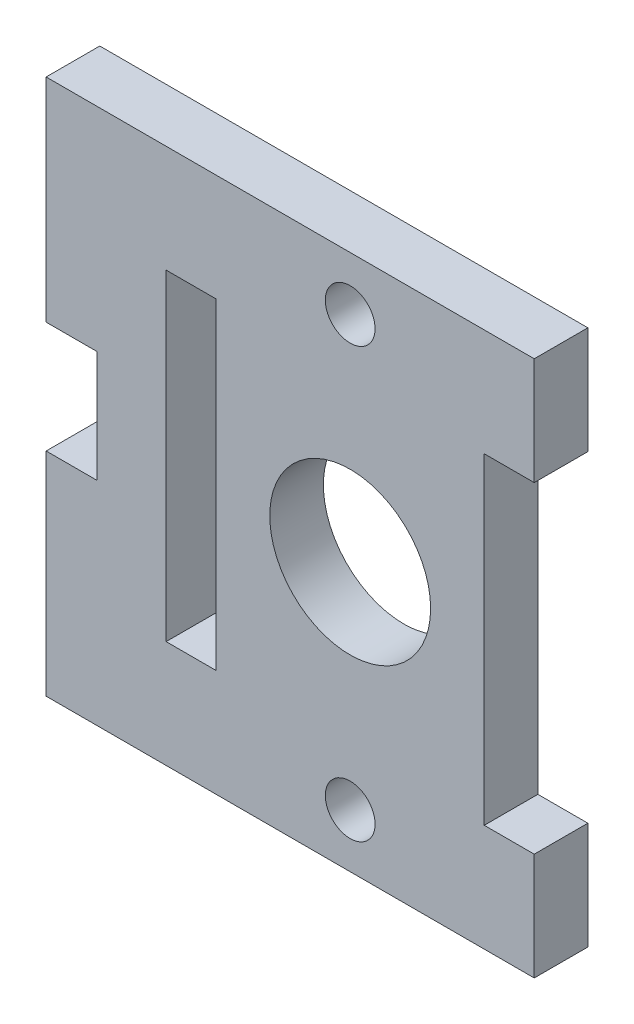
ISO-10303-21;
HEADER;
FILE_DESCRIPTION(('STEP AP214'),'2;1');
FILE_NAME('part.step','',(''),(''),'','','');
FILE_SCHEMA(('AUTOMOTIVE_DESIGN { 1 0 10303 214 1 1 1 1 }'));
ENDSEC;
DATA;
#1=APPLICATION_CONTEXT('core data for automotive mechanical design processes');
#2=APPLICATION_PROTOCOL_DEFINITION('international standard','automotive_design',2000,#1);
#3=PRODUCT_CONTEXT('',#1,'mechanical');
#4=PRODUCT('Part','Part','',(#3));
#5=PRODUCT_RELATED_PRODUCT_CATEGORY('part','',(#4));
#6=PRODUCT_DEFINITION_FORMATION('','',#4);
#7=PRODUCT_DEFINITION_CONTEXT('part definition',#1,'design');
#8=PRODUCT_DEFINITION('design','',#6,#7);
#9=PRODUCT_DEFINITION_SHAPE('','',#8);
#10=(LENGTH_UNIT() NAMED_UNIT(*) SI_UNIT(.MILLI.,.METRE.));
#11=(NAMED_UNIT(*) PLANE_ANGLE_UNIT() SI_UNIT($,.RADIAN.));
#12=(NAMED_UNIT(*) SI_UNIT($,.STERADIAN.) SOLID_ANGLE_UNIT());
#13=UNCERTAINTY_MEASURE_WITH_UNIT(LENGTH_MEASURE(1.E-05),#10,'distance_accuracy_value','');
#14=(GEOMETRIC_REPRESENTATION_CONTEXT(3) GLOBAL_UNCERTAINTY_ASSIGNED_CONTEXT((#13)) GLOBAL_UNIT_ASSIGNED_CONTEXT((#10,
#11,#12)) REPRESENTATION_CONTEXT('',''));
#15=CARTESIAN_POINT('',(0.,0.,0.));
#16=DIRECTION('',(0.,0.,1.));
#17=DIRECTION('',(1.,0.,0.));
#18=AXIS2_PLACEMENT_3D('',#15,#16,#17);
#19=CARTESIAN_POINT('',(10.8966,3.175,3.175));
#20=DIRECTION('',(-1.,0.,0.));
#21=DIRECTION('',(0.,0.,1.));
#22=AXIS2_PLACEMENT_3D('',#19,#20,#21);
#23=PLANE('',#22);
#24=DIRECTION('',(0.,1.,0.));
#25=VECTOR('',#24,1.);
#26=CARTESIAN_POINT('',(10.8966,3.175,0.));
#27=LINE('',#26,#25);
#28=CARTESIAN_POINT('',(10.8966,-3.175,0.));
#29=VERTEX_POINT('',#28);
#30=CARTESIAN_POINT('',(10.8966,3.175,0.));
#31=VERTEX_POINT('',#30);
#32=EDGE_CURVE('E145',#29,#31,#27,.T.);
#33=ORIENTED_EDGE('',*,*,#32,.T.);
#34=DIRECTION('',(0.,0.,-1.));
#35=VECTOR('',#34,1.);
#36=CARTESIAN_POINT('',(10.8966,3.175,3.175));
#37=LINE('',#36,#35);
#38=CARTESIAN_POINT('',(10.8966,3.175,3.175));
#39=VERTEX_POINT('',#38);
#40=EDGE_CURVE('E11',#39,#31,#37,.T.);
#41=ORIENTED_EDGE('',*,*,#40,.F.);
#42=DIRECTION('',(0.,1.,0.));
#43=VECTOR('',#42,1.);
#44=CARTESIAN_POINT('',(10.8966,3.175,3.175));
#45=LINE('',#44,#43);
#46=CARTESIAN_POINT('',(10.8966,-3.175,3.175));
#47=VERTEX_POINT('',#46);
#48=EDGE_CURVE('E165',#47,#39,#45,.T.);
#49=ORIENTED_EDGE('',*,*,#48,.F.);
#50=DIRECTION('',(0.,0.,-1.));
#51=VECTOR('',#50,1.);
#52=CARTESIAN_POINT('',(10.8966,-3.175,3.175));
#53=LINE('',#52,#51);
#54=EDGE_CURVE('E141',#47,#29,#53,.T.);
#55=ORIENTED_EDGE('',*,*,#54,.T.);
#56=EDGE_LOOP('',(#33,#41,#49,#55));
#57=FACE_BOUND('',#56,.T.);
#58=ADVANCED_FACE('F33',(#57),#23,.F.);
#59=CARTESIAN_POINT('',(-10.8966,3.175,3.175));
#60=DIRECTION('',(0.,-1.,0.));
#61=DIRECTION('',(0.,0.,-1.));
#62=AXIS2_PLACEMENT_3D('',#59,#60,#61);
#63=PLANE('',#62);
#64=DIRECTION('',(-1.,0.,0.));
#65=VECTOR('',#64,1.);
#66=CARTESIAN_POINT('',(-10.8966,3.175,0.));
#67=LINE('',#66,#65);
#68=CARTESIAN_POINT('',(-18.,3.17499999999999,0.));
#69=VERTEX_POINT('',#68);
#70=EDGE_CURVE('E148',#31,#69,#67,.T.);
#71=ORIENTED_EDGE('',*,*,#70,.T.);
#72=DIRECTION('',(0.,0.,1.));
#73=VECTOR('',#72,1.);
#74=CARTESIAN_POINT('',(-18.,3.17499999999999,-32.5349164984329));
#75=LINE('',#74,#73);
#76=CARTESIAN_POINT('',(-18.,3.17499999999999,3.175));
#77=VERTEX_POINT('',#76);
#78=EDGE_CURVE('E226',#69,#77,#75,.T.);
#79=ORIENTED_EDGE('',*,*,#78,.T.);
#80=DIRECTION('',(-1.,0.,0.));
#81=VECTOR('',#80,1.);
#82=CARTESIAN_POINT('',(-10.8966,3.175,3.175));
#83=LINE('',#82,#81);
#84=EDGE_CURVE('E97',#39,#77,#83,.T.);
#85=ORIENTED_EDGE('',*,*,#84,.F.);
#86=ORIENTED_EDGE('',*,*,#40,.T.);
#87=EDGE_LOOP('',(#71,#79,#85,#86));
#88=FACE_BOUND('',#87,.T.);
#89=ADVANCED_FACE('F293',(#88),#63,.F.);
#90=CARTESIAN_POINT('',(-10.8966,-3.175,3.175));
#91=DIRECTION('',(0.,1.,0.));
#92=DIRECTION('',(0.,0.,1.));
#93=AXIS2_PLACEMENT_3D('',#90,#91,#92);
#94=PLANE('',#93);
#95=DIRECTION('',(1.,0.,0.));
#96=VECTOR('',#95,1.);
#97=CARTESIAN_POINT('',(-10.8966,-3.175,0.));
#98=LINE('',#97,#96);
#99=CARTESIAN_POINT('',(-10.8966,-3.175,0.));
#100=VERTEX_POINT('',#99);
#101=CARTESIAN_POINT('',(-7.9375,-3.175,0.));
#102=VERTEX_POINT('',#101);
#103=EDGE_CURVE('E152',#100,#102,#98,.T.);
#104=ORIENTED_EDGE('',*,*,#103,.T.);
#105=DIRECTION('',(0.,0.,-1.));
#106=VECTOR('',#105,1.);
#107=CARTESIAN_POINT('',(-7.9375,-3.175,3.175));
#108=LINE('',#107,#106);
#109=CARTESIAN_POINT('',(-7.9375,-3.175,3.175));
#110=VERTEX_POINT('',#109);
#111=EDGE_CURVE('E178',#110,#102,#108,.T.);
#112=ORIENTED_EDGE('',*,*,#111,.F.);
#113=DIRECTION('',(1.,0.,0.));
#114=VECTOR('',#113,1.);
#115=CARTESIAN_POINT('',(-10.8966,-3.175,3.175));
#116=LINE('',#115,#114);
#117=CARTESIAN_POINT('',(-10.8966,-3.175,3.175));
#118=VERTEX_POINT('',#117);
#119=EDGE_CURVE('E188',#118,#110,#116,.T.);
#120=ORIENTED_EDGE('',*,*,#119,.F.);
#121=DIRECTION('',(0.,0.,-1.));
#122=VECTOR('',#121,1.);
#123=CARTESIAN_POINT('',(-10.8966,-3.175,3.175));
#124=LINE('',#123,#122);
#125=EDGE_CURVE('E42',#118,#100,#124,.T.);
#126=ORIENTED_EDGE('',*,*,#125,.T.);
#127=EDGE_LOOP('',(#104,#112,#120,#126));
#128=FACE_BOUND('',#127,.T.);
#129=ADVANCED_FACE('F185',(#128),#94,.F.);
#130=CARTESIAN_POINT('',(-7.9375,-3.175,3.175));
#131=DIRECTION('',(1.,0.,0.));
#132=DIRECTION('',(0.,0.,-1.));
#133=AXIS2_PLACEMENT_3D('',#130,#131,#132);
#134=PLANE('',#133);
#135=DIRECTION('',(0.,-1.,0.));
#136=VECTOR('',#135,1.);
#137=CARTESIAN_POINT('',(-7.9375,-3.175,0.));
#138=LINE('',#137,#136);
#139=CARTESIAN_POINT('',(-7.9375,-22.225,0.));
#140=VERTEX_POINT('',#139);
#141=EDGE_CURVE('E154',#102,#140,#138,.T.);
#142=ORIENTED_EDGE('',*,*,#141,.T.);
#143=DIRECTION('',(0.,0.,-1.));
#144=VECTOR('',#143,1.);
#145=CARTESIAN_POINT('',(-7.9375,-22.225,3.175));
#146=LINE('',#145,#144);
#147=CARTESIAN_POINT('',(-7.9375,-22.225,3.175));
#148=VERTEX_POINT('',#147);
#149=EDGE_CURVE('E175',#148,#140,#146,.T.);
#150=ORIENTED_EDGE('',*,*,#149,.F.);
#151=DIRECTION('',(0.,-1.,0.));
#152=VECTOR('',#151,1.);
#153=CARTESIAN_POINT('',(-7.9375,-3.175,3.175));
#154=LINE('',#153,#152);
#155=EDGE_CURVE('E257',#110,#148,#154,.T.);
#156=ORIENTED_EDGE('',*,*,#155,.F.);
#157=ORIENTED_EDGE('',*,*,#111,.T.);
#158=EDGE_LOOP('',(#142,#150,#156,#157));
#159=FACE_BOUND('',#158,.T.);
#160=ADVANCED_FACE('F303',(#159),#134,.F.);
#161=CARTESIAN_POINT('',(-10.8966,-22.225,3.175));
#162=DIRECTION('',(0.,-1.,0.));
#163=DIRECTION('',(1.,0.,0.));
#164=AXIS2_PLACEMENT_3D('',#161,#162,#163);
#165=PLANE('',#164);
#166=DIRECTION('',(-1.,0.,0.));
#167=VECTOR('',#166,1.);
#168=CARTESIAN_POINT('',(-10.8966,-22.225,0.));
#169=LINE('',#168,#167);
#170=CARTESIAN_POINT('',(-10.8966,-22.225,0.));
#171=VERTEX_POINT('',#170);
#172=EDGE_CURVE('E156',#140,#171,#169,.T.);
#173=ORIENTED_EDGE('',*,*,#172,.T.);
#174=DIRECTION('',(0.,0.,-1.));
#175=VECTOR('',#174,1.);
#176=CARTESIAN_POINT('',(-10.8966,-22.225,3.175));
#177=LINE('',#176,#175);
#178=CARTESIAN_POINT('',(-10.8966,-22.225,3.175));
#179=VERTEX_POINT('',#178);
#180=EDGE_CURVE('E172',#179,#171,#177,.T.);
#181=ORIENTED_EDGE('',*,*,#180,.F.);
#182=DIRECTION('',(-1.,0.,0.));
#183=VECTOR('',#182,1.);
#184=CARTESIAN_POINT('',(-10.8966,-22.225,3.175));
#185=LINE('',#184,#183);
#186=EDGE_CURVE('E259',#148,#179,#185,.T.);
#187=ORIENTED_EDGE('',*,*,#186,.F.);
#188=ORIENTED_EDGE('',*,*,#149,.T.);
#189=EDGE_LOOP('',(#173,#181,#187,#188));
#190=FACE_BOUND('',#189,.T.);
#191=ADVANCED_FACE('F308',(#190),#165,.F.);
#192=CARTESIAN_POINT('',(-10.8966,-28.575,3.175));
#193=DIRECTION('',(0.,1.,0.));
#194=DIRECTION('',(0.,0.,1.));
#195=AXIS2_PLACEMENT_3D('',#192,#193,#194);
#196=PLANE('',#195);
#197=DIRECTION('',(1.,0.,0.));
#198=VECTOR('',#197,1.);
#199=CARTESIAN_POINT('',(-10.8966,-28.575,0.));
#200=LINE('',#199,#198);
#201=CARTESIAN_POINT('',(-18.,-28.575,0.));
#202=VERTEX_POINT('',#201);
#203=CARTESIAN_POINT('',(10.8966,-28.575,0.));
#204=VERTEX_POINT('',#203);
#205=EDGE_CURVE('E158',#202,#204,#200,.T.);
#206=ORIENTED_EDGE('',*,*,#205,.T.);
#207=DIRECTION('',(0.,0.,-1.));
#208=VECTOR('',#207,1.);
#209=CARTESIAN_POINT('',(10.8966,-28.575,3.175));
#210=LINE('',#209,#208);
#211=CARTESIAN_POINT('',(10.8966,-28.575,3.175));
#212=VERTEX_POINT('',#211);
#213=EDGE_CURVE('E169',#212,#204,#210,.T.);
#214=ORIENTED_EDGE('',*,*,#213,.F.);
#215=DIRECTION('',(1.,0.,0.));
#216=VECTOR('',#215,1.);
#217=CARTESIAN_POINT('',(-10.8966,-28.575,3.175));
#218=LINE('',#217,#216);
#219=CARTESIAN_POINT('',(-18.,-28.575,3.175));
#220=VERTEX_POINT('',#219);
#221=EDGE_CURVE('E261',#220,#212,#218,.T.);
#222=ORIENTED_EDGE('',*,*,#221,.F.);
#223=DIRECTION('',(0.,0.,1.));
#224=VECTOR('',#223,1.);
#225=CARTESIAN_POINT('',(-18.,-28.575,-32.5349164984329));
#226=LINE('',#225,#224);
#227=EDGE_CURVE('E227',#202,#220,#226,.T.);
#228=ORIENTED_EDGE('',*,*,#227,.F.);
#229=EDGE_LOOP('',(#206,#214,#222,#228));
#230=FACE_BOUND('',#229,.T.);
#231=ADVANCED_FACE('F268',(#230),#196,.F.);
#232=CARTESIAN_POINT('',(10.8966,-28.575,3.175));
#233=DIRECTION('',(-1.,0.,0.));
#234=DIRECTION('',(0.,0.,1.));
#235=AXIS2_PLACEMENT_3D('',#232,#233,#234);
#236=PLANE('',#235);
#237=DIRECTION('',(0.,1.,0.));
#238=VECTOR('',#237,1.);
#239=CARTESIAN_POINT('',(10.8966,-28.575,0.));
#240=LINE('',#239,#238);
#241=CARTESIAN_POINT('',(10.8966,-22.225,0.));
#242=VERTEX_POINT('',#241);
#243=EDGE_CURVE('E160',#204,#242,#240,.T.);
#244=ORIENTED_EDGE('',*,*,#243,.T.);
#245=DIRECTION('',(0.,0.,-1.));
#246=VECTOR('',#245,1.);
#247=CARTESIAN_POINT('',(10.8966,-22.225,3.175));
#248=LINE('',#247,#246);
#249=CARTESIAN_POINT('',(10.8966,-22.225,3.175));
#250=VERTEX_POINT('',#249);
#251=EDGE_CURVE('E136',#250,#242,#248,.T.);
#252=ORIENTED_EDGE('',*,*,#251,.F.);
#253=DIRECTION('',(0.,1.,0.));
#254=VECTOR('',#253,1.);
#255=CARTESIAN_POINT('',(10.8966,-28.575,3.175));
#256=LINE('',#255,#254);
#257=EDGE_CURVE('E127',#212,#250,#256,.T.);
#258=ORIENTED_EDGE('',*,*,#257,.F.);
#259=ORIENTED_EDGE('',*,*,#213,.T.);
#260=EDGE_LOOP('',(#244,#252,#258,#259));
#261=FACE_BOUND('',#260,.T.);
#262=ADVANCED_FACE('F272',(#261),#236,.F.);
#263=CARTESIAN_POINT('',(7.9375,-22.225,3.175));
#264=DIRECTION('',(0.,-1.,0.));
#265=DIRECTION('',(1.,0.,0.));
#266=AXIS2_PLACEMENT_3D('',#263,#264,#265);
#267=PLANE('',#266);
#268=DIRECTION('',(-1.,0.,0.));
#269=VECTOR('',#268,1.);
#270=CARTESIAN_POINT('',(7.9375,-22.225,0.));
#271=LINE('',#270,#269);
#272=CARTESIAN_POINT('',(7.9375,-22.225,0.));
#273=VERTEX_POINT('',#272);
#274=EDGE_CURVE('E135',#242,#273,#271,.T.);
#275=ORIENTED_EDGE('',*,*,#274,.T.);
#276=DIRECTION('',(0.,0.,-1.));
#277=VECTOR('',#276,1.);
#278=CARTESIAN_POINT('',(7.9375,-22.225,3.175));
#279=LINE('',#278,#277);
#280=CARTESIAN_POINT('',(7.9375,-22.225,3.175));
#281=VERTEX_POINT('',#280);
#282=EDGE_CURVE('E132',#281,#273,#279,.T.);
#283=ORIENTED_EDGE('',*,*,#282,.F.);
#284=DIRECTION('',(-1.,0.,0.));
#285=VECTOR('',#284,1.);
#286=CARTESIAN_POINT('',(7.9375,-22.225,3.175));
#287=LINE('',#286,#285);
#288=EDGE_CURVE('E119',#250,#281,#287,.T.);
#289=ORIENTED_EDGE('',*,*,#288,.F.);
#290=ORIENTED_EDGE('',*,*,#251,.T.);
#291=EDGE_LOOP('',(#275,#283,#289,#290));
#292=FACE_BOUND('',#291,.T.);
#293=ADVANCED_FACE('F133',(#292),#267,.F.);
#294=CARTESIAN_POINT('',(7.9375,-3.175,3.175));
#295=DIRECTION('',(-1.,0.,0.));
#296=DIRECTION('',(0.,0.,1.));
#297=AXIS2_PLACEMENT_3D('',#294,#295,#296);
#298=PLANE('',#297);
#299=DIRECTION('',(0.,1.,0.));
#300=VECTOR('',#299,1.);
#301=CARTESIAN_POINT('',(7.9375,-3.175,0.));
#302=LINE('',#301,#300);
#303=CARTESIAN_POINT('',(7.9375,-3.175,0.));
#304=VERTEX_POINT('',#303);
#305=EDGE_CURVE('E83',#273,#304,#302,.T.);
#306=ORIENTED_EDGE('',*,*,#305,.T.);
#307=DIRECTION('',(0.,0.,-1.));
#308=VECTOR('',#307,1.);
#309=CARTESIAN_POINT('',(7.9375,-3.175,3.175));
#310=LINE('',#309,#308);
#311=CARTESIAN_POINT('',(7.9375,-3.175,3.175));
#312=VERTEX_POINT('',#311);
#313=EDGE_CURVE('E137',#312,#304,#310,.T.);
#314=ORIENTED_EDGE('',*,*,#313,.F.);
#315=DIRECTION('',(0.,1.,0.));
#316=VECTOR('',#315,1.);
#317=CARTESIAN_POINT('',(7.9375,-3.175,3.175));
#318=LINE('',#317,#316);
#319=EDGE_CURVE('E125',#281,#312,#318,.T.);
#320=ORIENTED_EDGE('',*,*,#319,.F.);
#321=ORIENTED_EDGE('',*,*,#282,.T.);
#322=EDGE_LOOP('',(#306,#314,#320,#321));
#323=FACE_BOUND('',#322,.T.);
#324=ADVANCED_FACE('F139',(#323),#298,.F.);
#325=CARTESIAN_POINT('',(7.9375,-3.175,3.175));
#326=DIRECTION('',(0.,1.,0.));
#327=DIRECTION('',(0.,0.,1.));
#328=AXIS2_PLACEMENT_3D('',#325,#326,#327);
#329=PLANE('',#328);
#330=DIRECTION('',(1.,0.,0.));
#331=VECTOR('',#330,1.);
#332=CARTESIAN_POINT('',(7.9375,-3.175,0.));
#333=LINE('',#332,#331);
#334=EDGE_CURVE('E89',#304,#29,#333,.T.);
#335=ORIENTED_EDGE('',*,*,#334,.T.);
#336=ORIENTED_EDGE('',*,*,#54,.F.);
#337=DIRECTION('',(1.,0.,0.));
#338=VECTOR('',#337,1.);
#339=CARTESIAN_POINT('',(7.9375,-3.175,3.175));
#340=LINE('',#339,#338);
#341=EDGE_CURVE('E50',#312,#47,#340,.T.);
#342=ORIENTED_EDGE('',*,*,#341,.F.);
#343=ORIENTED_EDGE('',*,*,#313,.T.);
#344=EDGE_LOOP('',(#335,#336,#342,#343));
#345=FACE_BOUND('',#344,.T.);
#346=ADVANCED_FACE('F281',(#345),#329,.F.);
#347=CARTESIAN_POINT('',(0.,0.,3.175));
#348=DIRECTION('',(0.,0.,1.));
#349=DIRECTION('',(1.,0.,0.));
#350=AXIS2_PLACEMENT_3D('',#347,#348,#349);
#351=PLANE('',#350);
#352=DIRECTION('',(0.,-1.,0.));
#353=VECTOR('',#352,1.);
#354=CARTESIAN_POINT('',(-18.,-28.575,3.175));
#355=LINE('',#354,#353);
#356=CARTESIAN_POINT('',(-18.,-16.002,3.175));
#357=VERTEX_POINT('',#356);
#358=EDGE_CURVE('E222',#357,#220,#355,.T.);
#359=ORIENTED_EDGE('',*,*,#358,.T.);
#360=ORIENTED_EDGE('',*,*,#221,.T.);
#361=ORIENTED_EDGE('',*,*,#257,.T.);
#362=ORIENTED_EDGE('',*,*,#288,.T.);
#363=ORIENTED_EDGE('',*,*,#319,.T.);
#364=ORIENTED_EDGE('',*,*,#341,.T.);
#365=ORIENTED_EDGE('',*,*,#48,.T.);
#366=ORIENTED_EDGE('',*,*,#84,.T.);
#367=DIRECTION('',(0.,-1.,0.));
#368=VECTOR('',#367,1.);
#369=CARTESIAN_POINT('',(-18.,3.17499999999999,3.175));
#370=LINE('',#369,#368);
#371=CARTESIAN_POINT('',(-18.,-9.398,3.175));
#372=VERTEX_POINT('',#371);
#373=EDGE_CURVE('E210',#77,#372,#370,.T.);
#374=ORIENTED_EDGE('',*,*,#373,.T.);
#375=DIRECTION('',(1.,0.,0.));
#376=VECTOR('',#375,1.);
#377=CARTESIAN_POINT('',(-18.,-9.398,3.175));
#378=LINE('',#377,#376);
#379=CARTESIAN_POINT('',(-15.,-9.398,3.175));
#380=VERTEX_POINT('',#379);
#381=EDGE_CURVE('E213',#372,#380,#378,.T.);
#382=ORIENTED_EDGE('',*,*,#381,.T.);
#383=DIRECTION('',(0.,-1.,0.));
#384=VECTOR('',#383,1.);
#385=CARTESIAN_POINT('',(-15.,-9.398,3.175));
#386=LINE('',#385,#384);
#387=CARTESIAN_POINT('',(-15.,-16.002,3.175));
#388=VERTEX_POINT('',#387);
#389=EDGE_CURVE('E216',#380,#388,#386,.T.);
#390=ORIENTED_EDGE('',*,*,#389,.T.);
#391=DIRECTION('',(-1.,0.,0.));
#392=VECTOR('',#391,1.);
#393=CARTESIAN_POINT('',(-18.,-16.002,3.175));
#394=LINE('',#393,#392);
#395=EDGE_CURVE('E219',#388,#357,#394,.T.);
#396=ORIENTED_EDGE('',*,*,#395,.T.);
#397=EDGE_LOOP('',(#359,#360,#361,#362,#363,#364,#365,#366,#374,#382,#390,#396));
#398=FACE_BOUND('',#397,.T.);
#399=CARTESIAN_POINT('',(0.,-12.7,3.175));
#400=DIRECTION('',(0.,0.,1.));
#401=DIRECTION('',(1.,0.,0.));
#402=AXIS2_PLACEMENT_3D('',#399,#400,#401);
#403=CIRCLE('',#402,4.7625);
#404=CARTESIAN_POINT('',(4.7625,-12.7,3.175));
#405=VERTEX_POINT('',#404);
#406=EDGE_CURVE('E199',#405,#405,#403,.T.);
#407=ORIENTED_EDGE('',*,*,#406,.F.);
#408=EDGE_LOOP('',(#407));
#409=FACE_BOUND('',#408,.T.);
#410=CARTESIAN_POINT('',(0.,0.,3.175));
#411=DIRECTION('',(0.,0.,1.));
#412=DIRECTION('',(1.,0.,0.));
#413=AXIS2_PLACEMENT_3D('',#410,#411,#412);
#414=CIRCLE('',#413,1.47319999999999);
#415=CARTESIAN_POINT('',(1.47319999999999,0.,3.175));
#416=VERTEX_POINT('',#415);
#417=EDGE_CURVE('E246',#416,#416,#414,.T.);
#418=ORIENTED_EDGE('',*,*,#417,.F.);
#419=EDGE_LOOP('',(#418));
#420=FACE_BOUND('',#419,.T.);
#421=CARTESIAN_POINT('',(0.,-25.4,3.175));
#422=DIRECTION('',(0.,0.,1.));
#423=DIRECTION('',(1.,0.,0.));
#424=AXIS2_PLACEMENT_3D('',#421,#422,#423);
#425=CIRCLE('',#424,1.47319999999999);
#426=CARTESIAN_POINT('',(1.47319999999999,-25.4,3.175));
#427=VERTEX_POINT('',#426);
#428=EDGE_CURVE('E249',#427,#427,#425,.T.);
#429=ORIENTED_EDGE('',*,*,#428,.F.);
#430=EDGE_LOOP('',(#429));
#431=FACE_BOUND('',#430,.T.);
#432=ORIENTED_EDGE('',*,*,#186,.T.);
#433=DIRECTION('',(0.,1.,0.));
#434=VECTOR('',#433,1.);
#435=CARTESIAN_POINT('',(-10.8966,-3.175,3.175));
#436=LINE('',#435,#434);
#437=EDGE_CURVE('E224',#179,#118,#436,.T.);
#438=ORIENTED_EDGE('',*,*,#437,.T.);
#439=ORIENTED_EDGE('',*,*,#119,.T.);
#440=ORIENTED_EDGE('',*,*,#155,.T.);
#441=EDGE_LOOP('',(#432,#438,#439,#440));
#442=FACE_BOUND('',#441,.T.);
#443=ADVANCED_FACE('F122',(#398,#409,#420,#431,#442),#351,.T.);
#444=CARTESIAN_POINT('',(0.,0.,0.));
#445=DIRECTION('',(0.,0.,1.));
#446=DIRECTION('',(1.,0.,0.));
#447=AXIS2_PLACEMENT_3D('',#444,#445,#446);
#448=PLANE('',#447);
#449=ORIENTED_EDGE('',*,*,#205,.F.);
#450=DIRECTION('',(0.,1.,0.));
#451=VECTOR('',#450,1.);
#452=CARTESIAN_POINT('',(-18.,-28.575,0.));
#453=LINE('',#452,#451);
#454=CARTESIAN_POINT('',(-18.,-16.002,0.));
#455=VERTEX_POINT('',#454);
#456=EDGE_CURVE('E200',#202,#455,#453,.T.);
#457=ORIENTED_EDGE('',*,*,#456,.T.);
#458=DIRECTION('',(1.,0.,0.));
#459=VECTOR('',#458,1.);
#460=CARTESIAN_POINT('',(-18.,-16.002,0.));
#461=LINE('',#460,#459);
#462=CARTESIAN_POINT('',(-15.,-16.002,0.));
#463=VERTEX_POINT('',#462);
#464=EDGE_CURVE('E206',#455,#463,#461,.T.);
#465=ORIENTED_EDGE('',*,*,#464,.T.);
#466=DIRECTION('',(0.,1.,0.));
#467=VECTOR('',#466,1.);
#468=CARTESIAN_POINT('',(-15.,-9.398,0.));
#469=LINE('',#468,#467);
#470=CARTESIAN_POINT('',(-15.,-9.398,0.));
#471=VERTEX_POINT('',#470);
#472=EDGE_CURVE('E490',#463,#471,#469,.T.);
#473=ORIENTED_EDGE('',*,*,#472,.T.);
#474=DIRECTION('',(-1.,0.,0.));
#475=VECTOR('',#474,1.);
#476=CARTESIAN_POINT('',(-18.,-9.398,0.));
#477=LINE('',#476,#475);
#478=CARTESIAN_POINT('',(-18.,-9.398,0.));
#479=VERTEX_POINT('',#478);
#480=EDGE_CURVE('E464',#471,#479,#477,.T.);
#481=ORIENTED_EDGE('',*,*,#480,.T.);
#482=DIRECTION('',(0.,1.,0.));
#483=VECTOR('',#482,1.);
#484=CARTESIAN_POINT('',(-18.,3.17499999999999,0.));
#485=LINE('',#484,#483);
#486=EDGE_CURVE('E230',#479,#69,#485,.T.);
#487=ORIENTED_EDGE('',*,*,#486,.T.);
#488=ORIENTED_EDGE('',*,*,#70,.F.);
#489=ORIENTED_EDGE('',*,*,#32,.F.);
#490=ORIENTED_EDGE('',*,*,#334,.F.);
#491=ORIENTED_EDGE('',*,*,#305,.F.);
#492=ORIENTED_EDGE('',*,*,#274,.F.);
#493=ORIENTED_EDGE('',*,*,#243,.F.);
#494=EDGE_LOOP('',(#449,#457,#465,#473,#481,#487,#488,#489,#490,#491,#492,#493));
#495=FACE_BOUND('',#494,.T.);
#496=CARTESIAN_POINT('',(0.,-12.7,0.));
#497=DIRECTION('',(0.,0.,1.));
#498=DIRECTION('',(1.,0.,0.));
#499=AXIS2_PLACEMENT_3D('',#496,#497,#498);
#500=CIRCLE('',#499,4.7625);
#501=CARTESIAN_POINT('',(4.7625,-12.7,0.));
#502=VERTEX_POINT('',#501);
#503=EDGE_CURVE('E203',#502,#502,#500,.F.);
#504=ORIENTED_EDGE('',*,*,#503,.F.);
#505=EDGE_LOOP('',(#504));
#506=FACE_BOUND('',#505,.T.);
#507=CARTESIAN_POINT('',(0.,0.,0.));
#508=DIRECTION('',(0.,0.,1.));
#509=DIRECTION('',(1.,0.,0.));
#510=AXIS2_PLACEMENT_3D('',#507,#508,#509);
#511=CIRCLE('',#510,1.47319999999999);
#512=CARTESIAN_POINT('',(1.47319999999999,0.,0.));
#513=VERTEX_POINT('',#512);
#514=EDGE_CURVE('E36',#513,#513,#511,.T.);
#515=ORIENTED_EDGE('',*,*,#514,.T.);
#516=EDGE_LOOP('',(#515));
#517=FACE_BOUND('',#516,.T.);
#518=CARTESIAN_POINT('',(0.,-25.4,0.));
#519=DIRECTION('',(0.,0.,1.));
#520=DIRECTION('',(1.,0.,0.));
#521=AXIS2_PLACEMENT_3D('',#518,#519,#520);
#522=CIRCLE('',#521,1.47319999999999);
#523=CARTESIAN_POINT('',(1.47319999999999,-25.4,0.));
#524=VERTEX_POINT('',#523);
#525=EDGE_CURVE('E149',#524,#524,#522,.T.);
#526=ORIENTED_EDGE('',*,*,#525,.T.);
#527=EDGE_LOOP('',(#526));
#528=FACE_BOUND('',#527,.T.);
#529=DIRECTION('',(0.,-1.,0.));
#530=VECTOR('',#529,1.);
#531=CARTESIAN_POINT('',(-10.8966,-3.175,0.));
#532=LINE('',#531,#530);
#533=EDGE_CURVE('E194',#100,#171,#532,.T.);
#534=ORIENTED_EDGE('',*,*,#533,.T.);
#535=ORIENTED_EDGE('',*,*,#172,.F.);
#536=ORIENTED_EDGE('',*,*,#141,.F.);
#537=ORIENTED_EDGE('',*,*,#103,.F.);
#538=EDGE_LOOP('',(#534,#535,#536,#537));
#539=FACE_BOUND('',#538,.T.);
#540=ADVANCED_FACE('F274',(#495,#506,#517,#528,#539),#448,.F.);
#541=CARTESIAN_POINT('',(0.,-25.4,3.175));
#542=DIRECTION('',(0.,0.,1.));
#543=DIRECTION('',(1.,0.,0.));
#544=AXIS2_PLACEMENT_3D('',#541,#542,#543);
#545=CYLINDRICAL_SURFACE('',#544,1.47319999999999);
#546=ORIENTED_EDGE('',*,*,#428,.T.);
#547=EDGE_LOOP('',(#546));
#548=FACE_BOUND('',#547,.T.);
#549=ORIENTED_EDGE('',*,*,#525,.F.);
#550=EDGE_LOOP('',(#549));
#551=FACE_BOUND('',#550,.T.);
#552=ADVANCED_FACE('F336',(#548,#551),#545,.F.);
#553=CARTESIAN_POINT('',(0.,0.,3.175));
#554=DIRECTION('',(0.,0.,1.));
#555=DIRECTION('',(1.,0.,0.));
#556=AXIS2_PLACEMENT_3D('',#553,#554,#555);
#557=CYLINDRICAL_SURFACE('',#556,1.47319999999999);
#558=ORIENTED_EDGE('',*,*,#417,.T.);
#559=EDGE_LOOP('',(#558));
#560=FACE_BOUND('',#559,.T.);
#561=ORIENTED_EDGE('',*,*,#514,.F.);
#562=EDGE_LOOP('',(#561));
#563=FACE_BOUND('',#562,.T.);
#564=ADVANCED_FACE('F340',(#560,#563),#557,.F.);
#565=CARTESIAN_POINT('',(0.,-12.7,-0.00100000000000013));
#566=DIRECTION('',(0.,0.,1.));
#567=DIRECTION('',(1.,0.,0.));
#568=AXIS2_PLACEMENT_3D('',#565,#566,#567);
#569=CYLINDRICAL_SURFACE('',#568,4.7625);
#570=ORIENTED_EDGE('',*,*,#406,.T.);
#571=EDGE_LOOP('',(#570));
#572=FACE_BOUND('',#571,.T.);
#573=ORIENTED_EDGE('',*,*,#503,.T.);
#574=EDGE_LOOP('',(#573));
#575=FACE_BOUND('',#574,.T.);
#576=ADVANCED_FACE('F351',(#572,#575),#569,.F.);
#577=CARTESIAN_POINT('',(-10.8966,-3.175,-32.5349164984329));
#578=DIRECTION('',(1.,0.,0.));
#579=DIRECTION('',(0.,0.,-1.));
#580=AXIS2_PLACEMENT_3D('',#577,#578,#579);
#581=PLANE('',#580);
#582=ORIENTED_EDGE('',*,*,#125,.F.);
#583=ORIENTED_EDGE('',*,*,#437,.F.);
#584=ORIENTED_EDGE('',*,*,#180,.T.);
#585=ORIENTED_EDGE('',*,*,#533,.F.);
#586=EDGE_LOOP('',(#582,#583,#584,#585));
#587=FACE_BOUND('',#586,.T.);
#588=ADVANCED_FACE('F195',(#587),#581,.T.);
#589=CARTESIAN_POINT('',(-18.,-28.575,-32.5349164984329));
#590=DIRECTION('',(-1.,0.,0.));
#591=DIRECTION('',(0.,-1.,0.));
#592=AXIS2_PLACEMENT_3D('',#589,#590,#591);
#593=PLANE('',#592);
#594=ORIENTED_EDGE('',*,*,#456,.F.);
#595=ORIENTED_EDGE('',*,*,#227,.T.);
#596=ORIENTED_EDGE('',*,*,#358,.F.);
#597=DIRECTION('',(0.,0.,1.));
#598=VECTOR('',#597,1.);
#599=CARTESIAN_POINT('',(-18.,-16.002,-32.5349164984329));
#600=LINE('',#599,#598);
#601=EDGE_CURVE('E231',#455,#357,#600,.T.);
#602=ORIENTED_EDGE('',*,*,#601,.F.);
#603=EDGE_LOOP('',(#594,#595,#596,#602));
#604=FACE_BOUND('',#603,.T.);
#605=ADVANCED_FACE('F401',(#604),#593,.T.);
#606=CARTESIAN_POINT('',(-18.,-16.002,-32.5349164984329));
#607=DIRECTION('',(0.,1.,0.));
#608=DIRECTION('',(-1.,0.,0.));
#609=AXIS2_PLACEMENT_3D('',#606,#607,#608);
#610=PLANE('',#609);
#611=ORIENTED_EDGE('',*,*,#464,.F.);
#612=ORIENTED_EDGE('',*,*,#601,.T.);
#613=ORIENTED_EDGE('',*,*,#395,.F.);
#614=DIRECTION('',(0.,0.,1.));
#615=VECTOR('',#614,1.);
#616=CARTESIAN_POINT('',(-15.,-16.002,-32.5349164984329));
#617=LINE('',#616,#615);
#618=EDGE_CURVE('E234',#463,#388,#617,.T.);
#619=ORIENTED_EDGE('',*,*,#618,.F.);
#620=EDGE_LOOP('',(#611,#612,#613,#619));
#621=FACE_BOUND('',#620,.T.);
#622=ADVANCED_FACE('F411',(#621),#610,.T.);
#623=CARTESIAN_POINT('',(-15.,-9.398,-32.5349164984329));
#624=DIRECTION('',(-1.,0.,0.));
#625=DIRECTION('',(0.,0.,1.));
#626=AXIS2_PLACEMENT_3D('',#623,#624,#625);
#627=PLANE('',#626);
#628=ORIENTED_EDGE('',*,*,#472,.F.);
#629=ORIENTED_EDGE('',*,*,#618,.T.);
#630=ORIENTED_EDGE('',*,*,#389,.F.);
#631=DIRECTION('',(0.,0.,1.));
#632=VECTOR('',#631,1.);
#633=CARTESIAN_POINT('',(-15.,-9.398,-32.5349164984329));
#634=LINE('',#633,#632);
#635=EDGE_CURVE('E237',#471,#380,#634,.T.);
#636=ORIENTED_EDGE('',*,*,#635,.F.);
#637=EDGE_LOOP('',(#628,#629,#630,#636));
#638=FACE_BOUND('',#637,.T.);
#639=ADVANCED_FACE('F421',(#638),#627,.T.);
#640=CARTESIAN_POINT('',(-18.,-9.398,-32.5349164984329));
#641=DIRECTION('',(0.,-1.,0.));
#642=DIRECTION('',(1.,0.,0.));
#643=AXIS2_PLACEMENT_3D('',#640,#641,#642);
#644=PLANE('',#643);
#645=ORIENTED_EDGE('',*,*,#480,.F.);
#646=ORIENTED_EDGE('',*,*,#635,.T.);
#647=ORIENTED_EDGE('',*,*,#381,.F.);
#648=DIRECTION('',(0.,0.,1.));
#649=VECTOR('',#648,1.);
#650=CARTESIAN_POINT('',(-18.,-9.398,-32.5349164984329));
#651=LINE('',#650,#649);
#652=EDGE_CURVE('E240',#479,#372,#651,.T.);
#653=ORIENTED_EDGE('',*,*,#652,.F.);
#654=EDGE_LOOP('',(#645,#646,#647,#653));
#655=FACE_BOUND('',#654,.T.);
#656=ADVANCED_FACE('F431',(#655),#644,.T.);
#657=CARTESIAN_POINT('',(-18.,3.17499999999999,-32.5349164984329));
#658=DIRECTION('',(-1.,0.,0.));
#659=DIRECTION('',(0.,0.,1.));
#660=AXIS2_PLACEMENT_3D('',#657,#658,#659);
#661=PLANE('',#660);
#662=ORIENTED_EDGE('',*,*,#486,.F.);
#663=ORIENTED_EDGE('',*,*,#652,.T.);
#664=ORIENTED_EDGE('',*,*,#373,.F.);
#665=ORIENTED_EDGE('',*,*,#78,.F.);
#666=EDGE_LOOP('',(#662,#663,#664,#665));
#667=FACE_BOUND('',#666,.T.);
#668=ADVANCED_FACE('F441',(#667),#661,.T.);
#669=CLOSED_SHELL('',(#58,#89,#129,#160,#191,#231,#262,#293,#324,#346,#443,#540,#552,#564,#576,
#588,#605,#622,#639,#656,#668));
#670=MANIFOLD_SOLID_BREP('B2',#669);
#671=ADVANCED_BREP_SHAPE_REPRESENTATION('',(#18,#670),#14);
#672=SHAPE_DEFINITION_REPRESENTATION(#9,#671);
ENDSEC;
END-ISO-10303-21;
